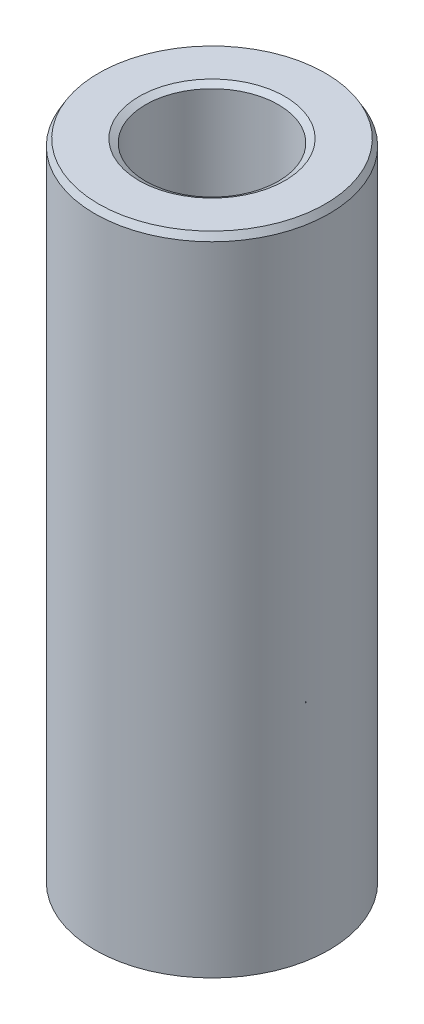
ISO-10303-21;
HEADER;
FILE_DESCRIPTION(('STEP AP214'),'2;1');
FILE_NAME('part.step','',(''),(''),'','','');
FILE_SCHEMA(('AUTOMOTIVE_DESIGN { 1 0 10303 214 1 1 1 1 }'));
ENDSEC;
DATA;
#1=APPLICATION_CONTEXT('core data for automotive mechanical design processes');
#2=APPLICATION_PROTOCOL_DEFINITION('international standard','automotive_design',2000,#1);
#3=PRODUCT_CONTEXT('',#1,'mechanical');
#4=PRODUCT('Part','Part','',(#3));
#5=PRODUCT_RELATED_PRODUCT_CATEGORY('part','',(#4));
#6=PRODUCT_DEFINITION_FORMATION('','',#4);
#7=PRODUCT_DEFINITION_CONTEXT('part definition',#1,'design');
#8=PRODUCT_DEFINITION('design','',#6,#7);
#9=PRODUCT_DEFINITION_SHAPE('','',#8);
#10=(LENGTH_UNIT() NAMED_UNIT(*) SI_UNIT(.MILLI.,.METRE.));
#11=(NAMED_UNIT(*) PLANE_ANGLE_UNIT() SI_UNIT($,.RADIAN.));
#12=(NAMED_UNIT(*) SI_UNIT($,.STERADIAN.) SOLID_ANGLE_UNIT());
#13=UNCERTAINTY_MEASURE_WITH_UNIT(LENGTH_MEASURE(1.E-05),#10,'distance_accuracy_value','');
#14=(GEOMETRIC_REPRESENTATION_CONTEXT(3) GLOBAL_UNCERTAINTY_ASSIGNED_CONTEXT((#13)) GLOBAL_UNIT_ASSIGNED_CONTEXT((#10,
#11,#12)) REPRESENTATION_CONTEXT('',''));
#15=CARTESIAN_POINT('',(0.,0.,0.));
#16=DIRECTION('',(0.,0.,1.));
#17=DIRECTION('',(1.,0.,0.));
#18=AXIS2_PLACEMENT_3D('',#15,#16,#17);
#19=CARTESIAN_POINT('',(0.,317.978610314226,0.));
#20=DIRECTION('',(0.,-1.,0.));
#21=DIRECTION('',(0.,0.,-1.));
#22=AXIS2_PLACEMENT_3D('',#19,#20,#21);
#23=CYLINDRICAL_SURFACE('',#22,57.5);
#24=CARTESIAN_POINT('',(0.,1.86085867862873,0.));
#25=DIRECTION('',(0.,1.,0.));
#26=DIRECTION('',(0.,0.,1.));
#27=AXIS2_PLACEMENT_3D('',#24,#25,#26);
#28=CIRCLE('',#27,57.5);
#29=CARTESIAN_POINT('',(0.,1.86085867862867,-57.5));
#30=VERTEX_POINT('',#29);
#31=EDGE_CURVE('E10',#30,#30,#28,.T.);
#32=CARTESIAN_POINT('',(0.,314.755508537136,0.));
#33=DIRECTION('',(0.,1.,0.));
#34=DIRECTION('',(0.,0.,1.));
#35=AXIS2_PLACEMENT_3D('',#32,#33,#34);
#36=CIRCLE('',#35,57.5);
#37=CARTESIAN_POINT('',(0.,314.755508537136,-57.5));
#38=VERTEX_POINT('',#37);
#39=EDGE_CURVE('E50',#38,#38,#36,.F.);
#40=CARTESIAN_POINT('',(0.,1.86085867862867,-57.5));
#41=CARTESIAN_POINT('',(0.,5.12017794798811,-57.5));
#42=CARTESIAN_POINT('',(0.,8.37949721734756,-57.5));
#43=CARTESIAN_POINT('',(0.,14.8981357560665,-57.5));
#44=CARTESIAN_POINT('',(0.,18.1574550254259,-57.5));
#45=CARTESIAN_POINT('',(0.,24.6760935641448,-57.5));
#46=CARTESIAN_POINT('',(0.,27.9354128335043,-57.5));
#47=CARTESIAN_POINT('',(0.,34.4540513722232,-57.5));
#48=CARTESIAN_POINT('',(0.,37.7133706415826,-57.5));
#49=CARTESIAN_POINT('',(0.,44.2320091803015,-57.5));
#50=CARTESIAN_POINT('',(0.,47.491328449661,-57.5));
#51=CARTESIAN_POINT('',(0.,54.0099669883799,-57.5));
#52=CARTESIAN_POINT('',(0.,57.2692862577393,-57.5));
#53=CARTESIAN_POINT('',(0.,63.7879247964582,-57.5));
#54=CARTESIAN_POINT('',(0.,67.0472440658177,-57.5));
#55=CARTESIAN_POINT('',(0.,73.5658826045365,-57.5));
#56=CARTESIAN_POINT('',(0.,76.825201873896,-57.5));
#57=CARTESIAN_POINT('',(0.,83.3438404126149,-57.5));
#58=CARTESIAN_POINT('',(0.,86.6031596819744,-57.5));
#59=CARTESIAN_POINT('',(0.,93.1217982206933,-57.5));
#60=CARTESIAN_POINT('',(0.,96.3811174900527,-57.5));
#61=CARTESIAN_POINT('',(0.,102.899756028772,-57.5));
#62=CARTESIAN_POINT('',(0.,106.159075298131,-57.5));
#63=CARTESIAN_POINT('',(0.,112.67771383685,-57.5));
#64=CARTESIAN_POINT('',(0.,115.937033106209,-57.5));
#65=CARTESIAN_POINT('',(0.,122.455671644928,-57.5));
#66=CARTESIAN_POINT('',(0.,125.714990914288,-57.5));
#67=CARTESIAN_POINT('',(0.,132.233629453007,-57.5));
#68=CARTESIAN_POINT('',(0.,135.492948722366,-57.5));
#69=CARTESIAN_POINT('',(0.,142.011587261085,-57.5));
#70=CARTESIAN_POINT('',(0.,145.270906530444,-57.5));
#71=CARTESIAN_POINT('',(0.,151.789545069163,-57.5));
#72=CARTESIAN_POINT('',(0.,155.048864338523,-57.5));
#73=CARTESIAN_POINT('',(0.,161.567502877242,-57.5));
#74=CARTESIAN_POINT('',(0.,164.826822146601,-57.5));
#75=CARTESIAN_POINT('',(0.,171.34546068532,-57.5));
#76=CARTESIAN_POINT('',(0.,174.604779954679,-57.5));
#77=CARTESIAN_POINT('',(0.,181.123418493398,-57.5));
#78=CARTESIAN_POINT('',(0.,184.382737762758,-57.5));
#79=CARTESIAN_POINT('',(0.,190.901376301477,-57.5));
#80=CARTESIAN_POINT('',(0.,194.160695570836,-57.5));
#81=CARTESIAN_POINT('',(0.,200.679334109555,-57.5));
#82=CARTESIAN_POINT('',(0.,203.938653378914,-57.5));
#83=CARTESIAN_POINT('',(0.,210.457291917633,-57.5));
#84=CARTESIAN_POINT('',(0.,213.716611186993,-57.5));
#85=CARTESIAN_POINT('',(0.,220.235249725712,-57.5));
#86=CARTESIAN_POINT('',(0.,223.494568995071,-57.5));
#87=CARTESIAN_POINT('',(0.,230.01320753379,-57.5));
#88=CARTESIAN_POINT('',(0.,233.27252680315,-57.5));
#89=CARTESIAN_POINT('',(0.,239.791165341868,-57.5));
#90=CARTESIAN_POINT('',(0.,243.050484611228,-57.5));
#91=CARTESIAN_POINT('',(0.,249.569123149947,-57.5));
#92=CARTESIAN_POINT('',(0.,252.828442419306,-57.5));
#93=CARTESIAN_POINT('',(0.,259.347080958025,-57.5));
#94=CARTESIAN_POINT('',(0.,262.606400227385,-57.5));
#95=CARTESIAN_POINT('',(0.,269.125038766104,-57.5));
#96=CARTESIAN_POINT('',(0.,272.384358035463,-57.5));
#97=CARTESIAN_POINT('',(0.,278.902996574182,-57.5));
#98=CARTESIAN_POINT('',(0.,282.162315843541,-57.5));
#99=CARTESIAN_POINT('',(0.,288.68095438226,-57.5));
#100=CARTESIAN_POINT('',(0.,291.94027365162,-57.5));
#101=CARTESIAN_POINT('',(0.,298.458912190339,-57.5));
#102=CARTESIAN_POINT('',(0.,301.718231459698,-57.5));
#103=CARTESIAN_POINT('',(0.,308.236869998417,-57.5));
#104=CARTESIAN_POINT('',(0.,311.496189267776,-57.5));
#105=CARTESIAN_POINT('',(0.,314.755508537136,-57.5));
#106=B_SPLINE_CURVE_WITH_KNOTS('',3,(#40,#41,#42,#43,#44,#45,#46,#47,#48,#49,#50,#51,#52,#53,
#54,#55,#56,#57,#58,#59,#60,#61,#62,#63,#64,#65,#66,#67,#68,#69,#70,#71,#72,#73,#74,#75,#76,#77,
#78,#79,#80,#81,#82,#83,#84,#85,#86,#87,#88,#89,#90,#91,#92,#93,#94,#95,#96,#97,#98,#99,#100,
#101,#102,#103,#104,#105),.UNSPECIFIED.,.F.,.F.,(4,2,2,2,2,2,2,2,2,2,2,2,2,2,2,2,2,2,2,2,2,2,2,
2,2,2,2,2,2,2,2,2,4),(0.,9.77795780807833,19.5559156161567,29.333873424235,39.1118312323134,
48.8897890403918,58.6677468484701,68.4457046565484,78.2236624646268,88.0016202727051,
97.7795780807835,107.557535888862,117.33549369694,127.113451505019,136.891409313097,
146.669367121175,156.447324929254,166.225282737332,176.00324054541,185.781198353489,
195.559156161567,205.337113969645,215.115071777724,224.893029585802,234.67098739388,
244.448945201959,254.226903010037,264.004860818115,273.782818626194,283.560776434272,
293.33873424235,303.116692050429,312.894649858507),.UNSPECIFIED.);
#107=EDGE_CURVE('BSEAM39',#30,#38,#106,.T.);
#108=ORIENTED_EDGE('',*,*,#31,.T.);
#109=ORIENTED_EDGE('',*,*,#39,.T.);
#110=ORIENTED_EDGE('',*,*,#107,.T.);
#111=ORIENTED_EDGE('',*,*,#107,.F.);
#112=EDGE_LOOP('',(#108,#110,#109,#111));
#113=FACE_BOUND('',#112,.T.);
#114=ADVANCED_FACE('F39',(#113),#23,.T.);
#115=CARTESIAN_POINT('',(0.,317.978610314226,0.));
#116=DIRECTION('',(0.,1.,0.));
#117=DIRECTION('',(0.,0.,1.));
#118=AXIS2_PLACEMENT_3D('',#115,#116,#117);
#119=PLANE('',#118);
#120=CARTESIAN_POINT('',(0.,317.978610314226,0.));
#121=DIRECTION('',(0.,1.,0.));
#122=DIRECTION('',(0.,0.,1.));
#123=AXIS2_PLACEMENT_3D('',#120,#121,#122);
#124=CIRCLE('',#123,35.7965536776324);
#125=CARTESIAN_POINT('',(0.,317.978610314226,35.7965536776324));
#126=VERTEX_POINT('',#125);
#127=EDGE_CURVE('E58',#126,#126,#124,.F.);
#128=ORIENTED_EDGE('',*,*,#127,.T.);
#129=EDGE_LOOP('',(#128));
#130=FACE_BOUND('',#129,.T.);
#131=CARTESIAN_POINT('',(0.,317.978610314226,0.));
#132=DIRECTION('',(0.,1.,0.));
#133=DIRECTION('',(0.,0.,1.));
#134=AXIS2_PLACEMENT_3D('',#131,#132,#133);
#135=CIRCLE('',#134,55.6391413213713);
#136=CARTESIAN_POINT('',(0.,317.978610314226,-55.6391413213713));
#137=VERTEX_POINT('',#136);
#138=EDGE_CURVE('E61',#137,#137,#135,.T.);
#139=ORIENTED_EDGE('',*,*,#138,.T.);
#140=EDGE_LOOP('',(#139));
#141=FACE_BOUND('',#140,.T.);
#142=ADVANCED_FACE('F88',(#130,#141),#119,.T.);
#143=CARTESIAN_POINT('',(0.,0.,0.));
#144=DIRECTION('',(0.,1.,0.));
#145=DIRECTION('',(0.,0.,1.));
#146=AXIS2_PLACEMENT_3D('',#143,#144,#145);
#147=PLANE('',#146);
#148=CARTESIAN_POINT('',(0.,0.,0.));
#149=DIRECTION('',(0.,1.,0.));
#150=DIRECTION('',(0.,0.,1.));
#151=AXIS2_PLACEMENT_3D('',#148,#149,#150);
#152=CIRCLE('',#151,34.4343105791708);
#153=CARTESIAN_POINT('',(0.,0.,-34.4343105791708));
#154=VERTEX_POINT('',#153);
#155=EDGE_CURVE('E51',#154,#154,#152,.T.);
#156=ORIENTED_EDGE('',*,*,#155,.T.);
#157=EDGE_LOOP('',(#156));
#158=FACE_BOUND('',#157,.T.);
#159=CARTESIAN_POINT('',(0.,0.,0.));
#160=DIRECTION('',(0.,1.,0.));
#161=DIRECTION('',(0.,0.,1.));
#162=AXIS2_PLACEMENT_3D('',#159,#160,#161);
#163=CIRCLE('',#162,54.2768982229095);
#164=CARTESIAN_POINT('',(0.,0.,54.2768982229095));
#165=VERTEX_POINT('',#164);
#166=EDGE_CURVE('E54',#165,#165,#163,.F.);
#167=ORIENTED_EDGE('',*,*,#166,.T.);
#168=EDGE_LOOP('',(#167));
#169=FACE_BOUND('',#168,.T.);
#170=ADVANCED_FACE('F83',(#158,#169),#147,.F.);
#171=CARTESIAN_POINT('',(0.,317.978610314226,0.));
#172=DIRECTION('',(0.,-1.,0.));
#173=DIRECTION('',(0.,0.,-1.));
#174=AXIS2_PLACEMENT_3D('',#171,#172,#173);
#175=CYLINDRICAL_SURFACE('',#174,32.573451900542);
#176=CARTESIAN_POINT('',(0.,316.117751635598,0.));
#177=DIRECTION('',(0.,1.,0.));
#178=DIRECTION('',(0.,0.,1.));
#179=AXIS2_PLACEMENT_3D('',#176,#177,#178);
#180=CIRCLE('',#179,32.573451900542);
#181=CARTESIAN_POINT('',(0.,316.117751635598,-32.573451900542));
#182=VERTEX_POINT('',#181);
#183=EDGE_CURVE('E67',#182,#182,#180,.T.);
#184=CARTESIAN_POINT('',(0.,3.22310177709056,0.));
#185=DIRECTION('',(0.,1.,0.));
#186=DIRECTION('',(0.,0.,1.));
#187=AXIS2_PLACEMENT_3D('',#184,#185,#186);
#188=CIRCLE('',#187,32.573451900542);
#189=CARTESIAN_POINT('',(0.,3.22310177709056,-32.573451900542));
#190=VERTEX_POINT('',#189);
#191=EDGE_CURVE('E69',#190,#190,#188,.F.);
#192=CARTESIAN_POINT('',(0.,316.117751635598,-32.573451900542));
#193=CARTESIAN_POINT('',(0.,312.858432366238,-32.573451900542));
#194=CARTESIAN_POINT('',(0.,309.599113096879,-32.573451900542));
#195=CARTESIAN_POINT('',(0.,303.08047455816,-32.573451900542));
#196=CARTESIAN_POINT('',(0.,299.8211552888,-32.573451900542));
#197=CARTESIAN_POINT('',(0.,293.302516750081,-32.573451900542));
#198=CARTESIAN_POINT('',(0.,290.043197480722,-32.573451900542));
#199=CARTESIAN_POINT('',(0.,283.524558942003,-32.573451900542));
#200=CARTESIAN_POINT('',(0.,280.265239672644,-32.573451900542));
#201=CARTESIAN_POINT('',(0.,273.746601133925,-32.573451900542));
#202=CARTESIAN_POINT('',(0.,270.487281864565,-32.573451900542));
#203=CARTESIAN_POINT('',(0.,263.968643325846,-32.573451900542));
#204=CARTESIAN_POINT('',(0.,260.709324056487,-32.573451900542));
#205=CARTESIAN_POINT('',(0.,254.190685517768,-32.573451900542));
#206=CARTESIAN_POINT('',(0.,250.931366248409,-32.573451900542));
#207=CARTESIAN_POINT('',(0.,244.41272770969,-32.573451900542));
#208=CARTESIAN_POINT('',(0.,241.15340844033,-32.573451900542));
#209=CARTESIAN_POINT('',(0.,234.634769901611,-32.573451900542));
#210=CARTESIAN_POINT('',(0.,231.375450632252,-32.573451900542));
#211=CARTESIAN_POINT('',(0.,224.856812093533,-32.573451900542));
#212=CARTESIAN_POINT('',(0.,221.597492824174,-32.573451900542));
#213=CARTESIAN_POINT('',(0.,215.078854285455,-32.573451900542));
#214=CARTESIAN_POINT('',(0.,211.819535016095,-32.573451900542));
#215=CARTESIAN_POINT('',(0.,205.300896477376,-32.573451900542));
#216=CARTESIAN_POINT('',(0.,202.041577208017,-32.573451900542));
#217=CARTESIAN_POINT('',(0.,195.522938669298,-32.573451900542));
#218=CARTESIAN_POINT('',(0.,192.263619399939,-32.573451900542));
#219=CARTESIAN_POINT('',(0.,185.74498086122,-32.573451900542));
#220=CARTESIAN_POINT('',(0.,182.48566159186,-32.573451900542));
#221=CARTESIAN_POINT('',(0.,175.967023053141,-32.573451900542));
#222=CARTESIAN_POINT('',(0.,172.707703783782,-32.573451900542));
#223=CARTESIAN_POINT('',(0.,166.189065245063,-32.573451900542));
#224=CARTESIAN_POINT('',(0.,162.929745975703,-32.573451900542));
#225=CARTESIAN_POINT('',(0.,156.411107436985,-32.573451900542));
#226=CARTESIAN_POINT('',(0.,153.151788167625,-32.573451900542));
#227=CARTESIAN_POINT('',(0.,146.633149628906,-32.573451900542));
#228=CARTESIAN_POINT('',(0.,143.373830359547,-32.573451900542));
#229=CARTESIAN_POINT('',(0.,136.855191820828,-32.573451900542));
#230=CARTESIAN_POINT('',(0.,133.595872551468,-32.573451900542));
#231=CARTESIAN_POINT('',(0.,127.07723401275,-32.573451900542));
#232=CARTESIAN_POINT('',(0.,123.81791474339,-32.573451900542));
#233=CARTESIAN_POINT('',(0.,117.299276204671,-32.573451900542));
#234=CARTESIAN_POINT('',(0.,114.039956935312,-32.573451900542));
#235=CARTESIAN_POINT('',(0.,107.521318396593,-32.573451900542));
#236=CARTESIAN_POINT('',(0.,104.261999127233,-32.573451900542));
#237=CARTESIAN_POINT('',(0.,97.7433605885145,-32.573451900542));
#238=CARTESIAN_POINT('',(0.,94.4840413191551,-32.573451900542));
#239=CARTESIAN_POINT('',(0.,87.9654027804362,-32.573451900542));
#240=CARTESIAN_POINT('',(0.,84.7060835110767,-32.573451900542));
#241=CARTESIAN_POINT('',(0.,78.1874449723578,-32.573451900542));
#242=CARTESIAN_POINT('',(0.,74.9281257029984,-32.573451900542));
#243=CARTESIAN_POINT('',(0.,68.4094871642795,-32.573451900542));
#244=CARTESIAN_POINT('',(0.,65.1501678949201,-32.573451900542));
#245=CARTESIAN_POINT('',(0.,58.6315293562012,-32.573451900542));
#246=CARTESIAN_POINT('',(0.,55.3722100868417,-32.573451900542));
#247=CARTESIAN_POINT('',(0.,48.8535715481228,-32.573451900542));
#248=CARTESIAN_POINT('',(0.,45.5942522787633,-32.573451900542));
#249=CARTESIAN_POINT('',(0.,39.0756137400444,-32.573451900542));
#250=CARTESIAN_POINT('',(0.,35.816294470685,-32.573451900542));
#251=CARTESIAN_POINT('',(0.,29.2976559319661,-32.573451900542));
#252=CARTESIAN_POINT('',(0.,26.0383366626067,-32.573451900542));
#253=CARTESIAN_POINT('',(0.,19.5196981238878,-32.573451900542));
#254=CARTESIAN_POINT('',(0.,16.2603788545283,-32.573451900542));
#255=CARTESIAN_POINT('',(0.,9.74174031580945,-32.573451900542));
#256=CARTESIAN_POINT('',(0.,6.48242104645001,-32.573451900542));
#257=CARTESIAN_POINT('',(0.,3.22310177709056,-32.573451900542));
#258=B_SPLINE_CURVE_WITH_KNOTS('',3,(#192,#193,#194,#195,#196,#197,#198,#199,#200,#201,#202,
#203,#204,#205,#206,#207,#208,#209,#210,#211,#212,#213,#214,#215,#216,#217,#218,#219,#220,#221,
#222,#223,#224,#225,#226,#227,#228,#229,#230,#231,#232,#233,#234,#235,#236,#237,#238,#239,#240,
#241,#242,#243,#244,#245,#246,#247,#248,#249,#250,#251,#252,#253,#254,#255,#256,#257),
.UNSPECIFIED.,.F.,.F.,(4,2,2,2,2,2,2,2,2,2,2,2,2,2,2,2,2,2,2,2,2,2,2,2,2,2,2,2,2,2,2,2,4),(0.,
9.77795780807833,19.5559156161567,29.333873424235,39.1118312323133,48.8897890403917,
58.66774684847,68.4457046565484,78.2236624646267,88.0016202727051,97.7795780807834,
107.557535888862,117.33549369694,127.113451505018,136.891409313097,146.669367121175,
156.447324929253,166.225282737332,176.00324054541,185.781198353489,195.559156161567,
205.337113969645,215.115071777724,224.893029585802,234.67098739388,244.448945201959,
254.226903010037,264.004860818115,273.782818626194,283.560776434272,293.33873424235,
303.116692050429,312.894649858507),.UNSPECIFIED.);
#259=EDGE_CURVE('BSEAM71',#182,#190,#258,.T.);
#260=ORIENTED_EDGE('',*,*,#183,.T.);
#261=ORIENTED_EDGE('',*,*,#191,.T.);
#262=ORIENTED_EDGE('',*,*,#259,.T.);
#263=ORIENTED_EDGE('',*,*,#259,.F.);
#264=EDGE_LOOP('',(#260,#262,#261,#263));
#265=FACE_BOUND('',#264,.T.);
#266=ADVANCED_FACE('F71',(#265),#175,.F.);
#267=CARTESIAN_POINT('',(0.,316.117751635598,0.));
#268=DIRECTION('',(0.,1.,0.));
#269=DIRECTION('',(0.,0.,1.));
#270=AXIS2_PLACEMENT_3D('',#267,#268,#269);
#271=CONICAL_SURFACE('',#270,32.573451900542,1.04719755119659);
#272=ORIENTED_EDGE('',*,*,#127,.F.);
#273=EDGE_LOOP('',(#272));
#274=FACE_BOUND('',#273,.T.);
#275=ORIENTED_EDGE('',*,*,#183,.F.);
#276=EDGE_LOOP('',(#275));
#277=FACE_BOUND('',#276,.T.);
#278=ADVANCED_FACE('F77',(#274,#277),#271,.F.);
#279=CARTESIAN_POINT('',(0.,0.,0.));
#280=DIRECTION('',(0.,-1.,0.));
#281=DIRECTION('',(0.,0.,-1.));
#282=AXIS2_PLACEMENT_3D('',#279,#280,#281);
#283=CONICAL_SURFACE('',#282,34.4343105791708,0.523598775598294);
#284=CARTESIAN_POINT('',(0.,3.22310177709056,-32.573451900542));
#285=CARTESIAN_POINT('',(0.,3.18952780024587,-32.592835845111));
#286=CARTESIAN_POINT('',(0.,3.15595382340118,-32.6122197896801));
#287=CARTESIAN_POINT('',(0.,3.08880586971179,-32.6509876788182));
#288=CARTESIAN_POINT('',(0.,3.0552318928671,-32.6703716233872));
#289=CARTESIAN_POINT('',(0.,2.98808393917771,-32.7091395125253));
#290=CARTESIAN_POINT('',(0.,2.95450996233302,-32.7285234570944));
#291=CARTESIAN_POINT('',(0.,2.88736200864363,-32.7672913462325));
#292=CARTESIAN_POINT('',(0.,2.85378803179894,-32.7866752908015));
#293=CARTESIAN_POINT('',(0.,2.78664007810955,-32.8254431799396));
#294=CARTESIAN_POINT('',(0.,2.75306610126486,-32.8448271245087));
#295=CARTESIAN_POINT('',(0.,2.68591814757547,-32.8835950136468));
#296=CARTESIAN_POINT('',(0.,2.65234417073078,-32.9029789582158));
#297=CARTESIAN_POINT('',(0.,2.58519621704139,-32.9417468473539));
#298=CARTESIAN_POINT('',(0.,2.5516222401967,-32.961130791923));
#299=CARTESIAN_POINT('',(0.,2.48447428650731,-32.9998986810611));
#300=CARTESIAN_POINT('',(0.,2.45090030966262,-33.0192826256301));
#301=CARTESIAN_POINT('',(0.,2.38375235597323,-33.0580505147682));
#302=CARTESIAN_POINT('',(0.,2.35017837912854,-33.0774344593373));
#303=CARTESIAN_POINT('',(0.,2.28303042543915,-33.1162023484754));
#304=CARTESIAN_POINT('',(0.,2.24945644859446,-33.1355862930444));
#305=CARTESIAN_POINT('',(0.,2.18230849490507,-33.1743541821825));
#306=CARTESIAN_POINT('',(0.,2.14873451806038,-33.1937381267516));
#307=CARTESIAN_POINT('',(0.,2.08158656437099,-33.2325060158897));
#308=CARTESIAN_POINT('',(0.,2.0480125875263,-33.2518899604587));
#309=CARTESIAN_POINT('',(0.,1.98086463383691,-33.2906578495968));
#310=CARTESIAN_POINT('',(0.,1.94729065699222,-33.3100417941659));
#311=CARTESIAN_POINT('',(0.,1.88014270330283,-33.348809683304));
#312=CARTESIAN_POINT('',(0.,1.84656872645814,-33.368193627873));
#313=CARTESIAN_POINT('',(0.,1.77942077276875,-33.4069615170111));
#314=CARTESIAN_POINT('',(0.,1.74584679592406,-33.4263454615802));
#315=CARTESIAN_POINT('',(0.,1.67869884223467,-33.4651133507183));
#316=CARTESIAN_POINT('',(0.,1.64512486538998,-33.4844972952873));
#317=CARTESIAN_POINT('',(0.,1.57797691170059,-33.5232651844254));
#318=CARTESIAN_POINT('',(0.,1.5444029348559,-33.5426491289945));
#319=CARTESIAN_POINT('',(0.,1.47725498116651,-33.5814170181326));
#320=CARTESIAN_POINT('',(0.,1.44368100432182,-33.6008009627016));
#321=CARTESIAN_POINT('',(0.,1.37653305063243,-33.6395688518397));
#322=CARTESIAN_POINT('',(0.,1.34295907378774,-33.6589527964088));
#323=CARTESIAN_POINT('',(0.,1.27581112009835,-33.6977206855469));
#324=CARTESIAN_POINT('',(0.,1.24223714325365,-33.7171046301159));
#325=CARTESIAN_POINT('',(0.,1.17508918956427,-33.755872519254));
#326=CARTESIAN_POINT('',(0.,1.14151521271957,-33.7752564638231));
#327=CARTESIAN_POINT('',(0.,1.07436725903019,-33.8140243529612));
#328=CARTESIAN_POINT('',(0.,1.04079328218549,-33.8334082975302));
#329=CARTESIAN_POINT('',(0.,0.973645328496108,-33.8721761866683));
#330=CARTESIAN_POINT('',(0.,0.940071351651415,-33.8915601312374));
#331=CARTESIAN_POINT('',(0.,0.872923397962028,-33.9303280203755));
#332=CARTESIAN_POINT('',(0.,0.839349421117334,-33.9497119649445));
#333=CARTESIAN_POINT('',(0.,0.772201467427947,-33.9884798540826));
#334=CARTESIAN_POINT('',(0.,0.738627490583254,-34.0078637986517));
#335=CARTESIAN_POINT('',(0.,0.671479536893868,-34.0466316877898));
#336=CARTESIAN_POINT('',(0.,0.637905560049175,-34.0660156323588));
#337=CARTESIAN_POINT('',(0.,0.570757606359788,-34.1047835214969));
#338=CARTESIAN_POINT('',(0.,0.537183629515094,-34.124167466066));
#339=CARTESIAN_POINT('',(0.,0.470035675825707,-34.1629353552041));
#340=CARTESIAN_POINT('',(0.,0.436461698981014,-34.1823192997731));
#341=CARTESIAN_POINT('',(0.,0.369313745291627,-34.2210871889112));
#342=CARTESIAN_POINT('',(0.,0.335739768446934,-34.2404711334803));
#343=CARTESIAN_POINT('',(0.,0.268591814757547,-34.2792390226184));
#344=CARTESIAN_POINT('',(0.,0.235017837912854,-34.2986229671874));
#345=CARTESIAN_POINT('',(0.,0.167869884223467,-34.3373908563255));
#346=CARTESIAN_POINT('',(0.,0.134295907378774,-34.3567748008946));
#347=CARTESIAN_POINT('',(0.,0.0671479536893858,-34.3955426900327));
#348=CARTESIAN_POINT('',(0.,0.0335739768446919,-34.4149266346017));
#349=CARTESIAN_POINT('',(0.,0.,-34.4343105791708));
#350=B_SPLINE_CURVE_WITH_KNOTS('',3,(#284,#285,#286,#287,#288,#289,#290,#291,#292,#293,#294,
#295,#296,#297,#298,#299,#300,#301,#302,#303,#304,#305,#306,#307,#308,#309,#310,#311,#312,#313,
#314,#315,#316,#317,#318,#319,#320,#321,#322,#323,#324,#325,#326,#327,#328,#329,#330,#331,#332,
#333,#334,#335,#336,#337,#338,#339,#340,#341,#342,#343,#344,#345,#346,#347,#348,#349),
.UNSPECIFIED.,.F.,.F.,(4,2,2,2,2,2,2,2,2,2,2,2,2,2,2,2,2,2,2,2,2,2,2,2,2,2,2,2,2,2,2,2,4),(0.,
0.116303667414301,0.232607334828598,0.348911002242898,0.465214669657199,0.581518337071499,
0.697822004485796,0.814125671900097,0.930429339314398,1.04673300672869,1.163036674143,
1.2793403415573,1.3956440089716,1.51194767638589,1.62825134380019,1.74455501121449,
1.86085867862879,1.97716234604309,2.09346601345739,2.20976968087169,2.32607334828599,
2.44237701570029,2.55868068311459,2.67498435052889,2.79128801794319,2.90759168535749,
3.02389535277179,3.14019902018609,3.25650268760039,3.37280635501469,3.48911002242899,
3.60541368984328,3.72171735725758),.UNSPECIFIED.);
#351=EDGE_CURVE('BSEAM73',#190,#154,#350,.T.);
#352=ORIENTED_EDGE('',*,*,#191,.F.);
#353=ORIENTED_EDGE('',*,*,#155,.F.);
#354=ORIENTED_EDGE('',*,*,#351,.T.);
#355=ORIENTED_EDGE('',*,*,#351,.F.);
#356=EDGE_LOOP('',(#352,#354,#353,#355));
#357=FACE_BOUND('',#356,.T.);
#358=ADVANCED_FACE('F73',(#357),#283,.F.);
#359=CARTESIAN_POINT('',(0.,1.86085867862873,0.));
#360=DIRECTION('',(0.,1.,0.));
#361=DIRECTION('',(0.,0.,1.));
#362=AXIS2_PLACEMENT_3D('',#359,#360,#361);
#363=CONICAL_SURFACE('',#362,57.5,1.0471975511966);
#364=ORIENTED_EDGE('',*,*,#166,.F.);
#365=EDGE_LOOP('',(#364));
#366=FACE_BOUND('',#365,.T.);
#367=ORIENTED_EDGE('',*,*,#31,.F.);
#368=EDGE_LOOP('',(#367));
#369=FACE_BOUND('',#368,.T.);
#370=ADVANCED_FACE('F76',(#366,#369),#363,.T.);
#371=CARTESIAN_POINT('',(0.,317.978610314226,0.));
#372=DIRECTION('',(0.,-1.,0.));
#373=DIRECTION('',(0.,0.,-1.));
#374=AXIS2_PLACEMENT_3D('',#371,#372,#373);
#375=CONICAL_SURFACE('',#374,55.6391413213713,0.523598775598293);
#376=CARTESIAN_POINT('',(0.,314.755508537136,-57.5));
#377=CARTESIAN_POINT('',(0.,314.789082513981,-57.480616055431));
#378=CARTESIAN_POINT('',(0.,314.822656490825,-57.4612321108619));
#379=CARTESIAN_POINT('',(0.,314.889804444515,-57.4224642217238));
#380=CARTESIAN_POINT('',(0.,314.923378421359,-57.4030802771548));
#381=CARTESIAN_POINT('',(0.,314.990526375049,-57.3643123880167));
#382=CARTESIAN_POINT('',(0.,315.024100351893,-57.3449284434476));
#383=CARTESIAN_POINT('',(0.,315.091248305583,-57.3061605543095));
#384=CARTESIAN_POINT('',(0.,315.124822282427,-57.2867766097405));
#385=CARTESIAN_POINT('',(0.,315.191970236117,-57.2480087206024));
#386=CARTESIAN_POINT('',(0.,315.225544212961,-57.2286247760333));
#387=CARTESIAN_POINT('',(0.,315.292692166651,-57.1898568868952));
#388=CARTESIAN_POINT('',(0.,315.326266143496,-57.1704729423262));
#389=CARTESIAN_POINT('',(0.,315.393414097185,-57.1317050531881));
#390=CARTESIAN_POINT('',(0.,315.42698807403,-57.112321108619));
#391=CARTESIAN_POINT('',(0.,315.494136027719,-57.0735532194809));
#392=CARTESIAN_POINT('',(0.,315.527710004564,-57.0541692749119));
#393=CARTESIAN_POINT('',(0.,315.594857958253,-57.0154013857738));
#394=CARTESIAN_POINT('',(0.,315.628431935098,-56.9960174412047));
#395=CARTESIAN_POINT('',(0.,315.695579888787,-56.9572495520666));
#396=CARTESIAN_POINT('',(0.,315.729153865632,-56.9378656074976));
#397=CARTESIAN_POINT('',(0.,315.796301819321,-56.8990977183595));
#398=CARTESIAN_POINT('',(0.,315.829875796166,-56.8797137737905));
#399=CARTESIAN_POINT('',(0.,315.897023749855,-56.8409458846523));
#400=CARTESIAN_POINT('',(0.,315.9305977267,-56.8215619400833));
#401=CARTESIAN_POINT('',(0.,315.997745680389,-56.7827940509452));
#402=CARTESIAN_POINT('',(0.,316.031319657234,-56.7634101063761));
#403=CARTESIAN_POINT('',(0.,316.098467610924,-56.7246422172381));
#404=CARTESIAN_POINT('',(0.,316.132041587768,-56.705258272669));
#405=CARTESIAN_POINT('',(0.,316.199189541458,-56.6664903835309));
#406=CARTESIAN_POINT('',(0.,316.232763518302,-56.6471064389619));
#407=CARTESIAN_POINT('',(0.,316.299911471992,-56.6083385498238));
#408=CARTESIAN_POINT('',(0.,316.333485448836,-56.5889546052547));
#409=CARTESIAN_POINT('',(0.,316.400633402526,-56.5501867161166));
#410=CARTESIAN_POINT('',(0.,316.43420737937,-56.5308027715476));
#411=CARTESIAN_POINT('',(0.,316.50135533306,-56.4920348824095));
#412=CARTESIAN_POINT('',(0.,316.534929309904,-56.4726509378404));
#413=CARTESIAN_POINT('',(0.,316.602077263594,-56.4338830487023));
#414=CARTESIAN_POINT('',(0.,316.635651240439,-56.4144991041333));
#415=CARTESIAN_POINT('',(0.,316.702799194128,-56.3757312149952));
#416=CARTESIAN_POINT('',(0.,316.736373170973,-56.3563472704261));
#417=CARTESIAN_POINT('',(0.,316.803521124662,-56.317579381288));
#418=CARTESIAN_POINT('',(0.,316.837095101507,-56.298195436719));
#419=CARTESIAN_POINT('',(0.,316.904243055196,-56.2594275475809));
#420=CARTESIAN_POINT('',(0.,316.937817032041,-56.2400436030118));
#421=CARTESIAN_POINT('',(0.,317.00496498573,-56.2012757138737));
#422=CARTESIAN_POINT('',(0.,317.038538962575,-56.1818917693047));
#423=CARTESIAN_POINT('',(0.,317.105686916264,-56.1431238801666));
#424=CARTESIAN_POINT('',(0.,317.139260893109,-56.1237399355975));
#425=CARTESIAN_POINT('',(0.,317.206408846798,-56.0849720464594));
#426=CARTESIAN_POINT('',(0.,317.239982823643,-56.0655881018904));
#427=CARTESIAN_POINT('',(0.,317.307130777332,-56.0268202127523));
#428=CARTESIAN_POINT('',(0.,317.340704754177,-56.0074362681832));
#429=CARTESIAN_POINT('',(0.,317.407852707866,-55.9686683790451));
#430=CARTESIAN_POINT('',(0.,317.441426684711,-55.9492844344761));
#431=CARTESIAN_POINT('',(0.,317.508574638401,-55.910516545338));
#432=CARTESIAN_POINT('',(0.,317.542148615245,-55.8911326007689));
#433=CARTESIAN_POINT('',(0.,317.609296568935,-55.8523647116309));
#434=CARTESIAN_POINT('',(0.,317.642870545779,-55.8329807670618));
#435=CARTESIAN_POINT('',(0.,317.710018499469,-55.7942128779237));
#436=CARTESIAN_POINT('',(0.,317.743592476313,-55.7748289333547));
#437=CARTESIAN_POINT('',(0.,317.810740430003,-55.7360610442165));
#438=CARTESIAN_POINT('',(0.,317.844314406848,-55.7166770996475));
#439=CARTESIAN_POINT('',(0.,317.911462360537,-55.6779092105094));
#440=CARTESIAN_POINT('',(0.,317.945036337382,-55.6585252659404));
#441=CARTESIAN_POINT('',(0.,317.978610314226,-55.6391413213713));
#442=B_SPLINE_CURVE_WITH_KNOTS('',3,(#376,#377,#378,#379,#380,#381,#382,#383,#384,#385,#386,
#387,#388,#389,#390,#391,#392,#393,#394,#395,#396,#397,#398,#399,#400,#401,#402,#403,#404,#405,
#406,#407,#408,#409,#410,#411,#412,#413,#414,#415,#416,#417,#418,#419,#420,#421,#422,#423,#424,
#425,#426,#427,#428,#429,#430,#431,#432,#433,#434,#435,#436,#437,#438,#439,#440,#441),
.UNSPECIFIED.,.F.,.F.,(4,2,2,2,2,2,2,2,2,2,2,2,2,2,2,2,2,2,2,2,2,2,2,2,2,2,2,2,2,2,2,2,4),(0.,
0.116303667414332,0.232607334828615,0.348911002242902,0.465214669657186,0.581518337071521,
0.697822004485804,0.814125671900088,0.930429339314375,1.04673300672866,1.16303667414299,
1.27934034155728,1.39564400897156,1.51194767638585,1.62825134380018,1.74455501121447,
1.86085867862875,1.97716234604304,2.09346601345732,2.20976968087165,2.32607334828594,
2.44237701570022,2.55868068311451,2.67498435052884,2.79128801794312,2.90759168535741,
3.0238953527717,3.14019902018598,3.25650268760031,3.3728063550146,3.48911002242888,
3.60541368984317,3.7217173572575),.UNSPECIFIED.);
#443=EDGE_CURVE('BSEAM45',#38,#137,#442,.T.);
#444=ORIENTED_EDGE('',*,*,#39,.F.);
#445=ORIENTED_EDGE('',*,*,#138,.F.);
#446=ORIENTED_EDGE('',*,*,#443,.T.);
#447=ORIENTED_EDGE('',*,*,#443,.F.);
#448=EDGE_LOOP('',(#444,#446,#445,#447));
#449=FACE_BOUND('',#448,.T.);
#450=ADVANCED_FACE('F45',(#449),#375,.T.);
#451=CLOSED_SHELL('',(#114,#142,#170,#266,#278,#358,#370,#450));
#452=MANIFOLD_SOLID_BREP('B2',#451);
#453=ADVANCED_BREP_SHAPE_REPRESENTATION('',(#18,#452),#14);
#454=SHAPE_DEFINITION_REPRESENTATION(#9,#453);
ENDSEC;
END-ISO-10303-21;
